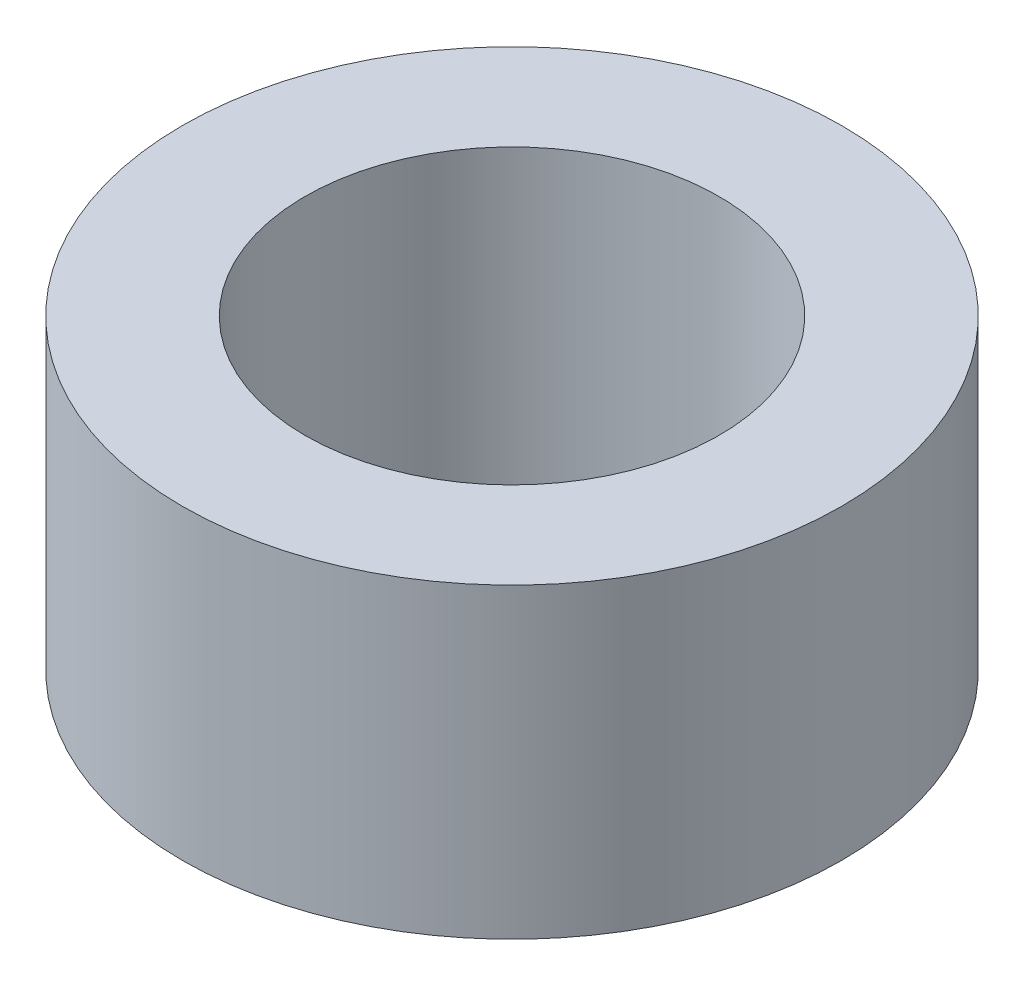
ISO-10303-21;
HEADER;
FILE_DESCRIPTION(('STEP AP214'),'2;1');
FILE_NAME('part.step','',(''),(''),'','','');
FILE_SCHEMA(('AUTOMOTIVE_DESIGN { 1 0 10303 214 1 1 1 1 }'));
ENDSEC;
DATA;
#1=APPLICATION_CONTEXT('core data for automotive mechanical design processes');
#2=APPLICATION_PROTOCOL_DEFINITION('international standard','automotive_design',2000,#1);
#3=PRODUCT_CONTEXT('',#1,'mechanical');
#4=PRODUCT('Part','Part','',(#3));
#5=PRODUCT_RELATED_PRODUCT_CATEGORY('part','',(#4));
#6=PRODUCT_DEFINITION_FORMATION('','',#4);
#7=PRODUCT_DEFINITION_CONTEXT('part definition',#1,'design');
#8=PRODUCT_DEFINITION('design','',#6,#7);
#9=PRODUCT_DEFINITION_SHAPE('','',#8);
#10=(LENGTH_UNIT() NAMED_UNIT(*) SI_UNIT(.MILLI.,.METRE.));
#11=(NAMED_UNIT(*) PLANE_ANGLE_UNIT() SI_UNIT($,.RADIAN.));
#12=(NAMED_UNIT(*) SI_UNIT($,.STERADIAN.) SOLID_ANGLE_UNIT());
#13=UNCERTAINTY_MEASURE_WITH_UNIT(LENGTH_MEASURE(1.E-05),#10,'distance_accuracy_value','');
#14=(GEOMETRIC_REPRESENTATION_CONTEXT(3) GLOBAL_UNCERTAINTY_ASSIGNED_CONTEXT((#13)) GLOBAL_UNIT_ASSIGNED_CONTEXT((#10,
#11,#12)) REPRESENTATION_CONTEXT('',''));
#15=CARTESIAN_POINT('',(0.,0.,0.));
#16=DIRECTION('',(0.,0.,1.));
#17=DIRECTION('',(1.,0.,0.));
#18=AXIS2_PLACEMENT_3D('',#15,#16,#17);
#19=CARTESIAN_POINT('',(0.,100.,0.));
#20=DIRECTION('',(0.,-1.,0.));
#21=DIRECTION('',(0.,0.,-1.));
#22=AXIS2_PLACEMENT_3D('',#19,#20,#21);
#23=CYLINDRICAL_SURFACE('',#22,107.5);
#24=CARTESIAN_POINT('',(0.,100.,0.));
#25=DIRECTION('',(0.,1.,0.));
#26=DIRECTION('',(0.,0.,1.));
#27=AXIS2_PLACEMENT_3D('',#24,#25,#26);
#28=CIRCLE('',#27,107.5);
#29=CARTESIAN_POINT('',(0.,100.,107.5));
#30=VERTEX_POINT('',#29);
#31=EDGE_CURVE('E10',#30,#30,#28,.T.);
#32=ORIENTED_EDGE('',*,*,#31,.F.);
#33=EDGE_LOOP('',(#32));
#34=FACE_BOUND('',#33,.T.);
#35=CARTESIAN_POINT('',(0.,0.,0.));
#36=DIRECTION('',(0.,1.,0.));
#37=DIRECTION('',(0.,0.,1.));
#38=AXIS2_PLACEMENT_3D('',#35,#36,#37);
#39=CIRCLE('',#38,107.5);
#40=CARTESIAN_POINT('',(0.,0.,107.5));
#41=VERTEX_POINT('',#40);
#42=EDGE_CURVE('E40',#41,#41,#39,.T.);
#43=ORIENTED_EDGE('',*,*,#42,.T.);
#44=EDGE_LOOP('',(#43));
#45=FACE_BOUND('',#44,.T.);
#46=ADVANCED_FACE('F37',(#34,#45),#23,.T.);
#47=CARTESIAN_POINT('',(0.,100.,0.));
#48=DIRECTION('',(0.,1.,0.));
#49=DIRECTION('',(0.,0.,1.));
#50=AXIS2_PLACEMENT_3D('',#47,#48,#49);
#51=PLANE('',#50);
#52=CARTESIAN_POINT('',(0.,100.,0.));
#53=DIRECTION('',(0.,1.,0.));
#54=DIRECTION('',(0.,0.,1.));
#55=AXIS2_PLACEMENT_3D('',#52,#53,#54);
#56=CIRCLE('',#55,67.5);
#57=CARTESIAN_POINT('',(0.,100.,67.5));
#58=VERTEX_POINT('',#57);
#59=EDGE_CURVE('E51',#58,#58,#56,.T.);
#60=ORIENTED_EDGE('',*,*,#59,.F.);
#61=EDGE_LOOP('',(#60));
#62=FACE_BOUND('',#61,.T.);
#63=ORIENTED_EDGE('',*,*,#31,.T.);
#64=EDGE_LOOP('',(#63));
#65=FACE_BOUND('',#64,.T.);
#66=ADVANCED_FACE('F68',(#62,#65),#51,.T.);
#67=CARTESIAN_POINT('',(0.,0.,0.));
#68=DIRECTION('',(0.,1.,0.));
#69=DIRECTION('',(0.,0.,1.));
#70=AXIS2_PLACEMENT_3D('',#67,#68,#69);
#71=PLANE('',#70);
#72=CARTESIAN_POINT('',(0.,0.,0.));
#73=DIRECTION('',(0.,1.,0.));
#74=DIRECTION('',(0.,0.,1.));
#75=AXIS2_PLACEMENT_3D('',#72,#73,#74);
#76=CIRCLE('',#75,67.5);
#77=CARTESIAN_POINT('',(0.,0.,67.5));
#78=VERTEX_POINT('',#77);
#79=EDGE_CURVE('E49',#78,#78,#76,.T.);
#80=ORIENTED_EDGE('',*,*,#79,.T.);
#81=EDGE_LOOP('',(#80));
#82=FACE_BOUND('',#81,.T.);
#83=ORIENTED_EDGE('',*,*,#42,.F.);
#84=EDGE_LOOP('',(#83));
#85=FACE_BOUND('',#84,.T.);
#86=ADVANCED_FACE('F59',(#82,#85),#71,.F.);
#87=CARTESIAN_POINT('',(0.,0.,0.));
#88=DIRECTION('',(0.,1.,0.));
#89=DIRECTION('',(0.,0.,1.));
#90=AXIS2_PLACEMENT_3D('',#87,#88,#89);
#91=CYLINDRICAL_SURFACE('',#90,67.5);
#92=ORIENTED_EDGE('',*,*,#79,.F.);
#93=EDGE_LOOP('',(#92));
#94=FACE_BOUND('',#93,.T.);
#95=ORIENTED_EDGE('',*,*,#59,.T.);
#96=EDGE_LOOP('',(#95));
#97=FACE_BOUND('',#96,.T.);
#98=ADVANCED_FACE('F62',(#94,#97),#91,.F.);
#99=CLOSED_SHELL('',(#46,#66,#86,#98));
#100=MANIFOLD_SOLID_BREP('B2',#99);
#101=ADVANCED_BREP_SHAPE_REPRESENTATION('',(#18,#100),#14);
#102=SHAPE_DEFINITION_REPRESENTATION(#9,#101);
ENDSEC;
END-ISO-10303-21;
